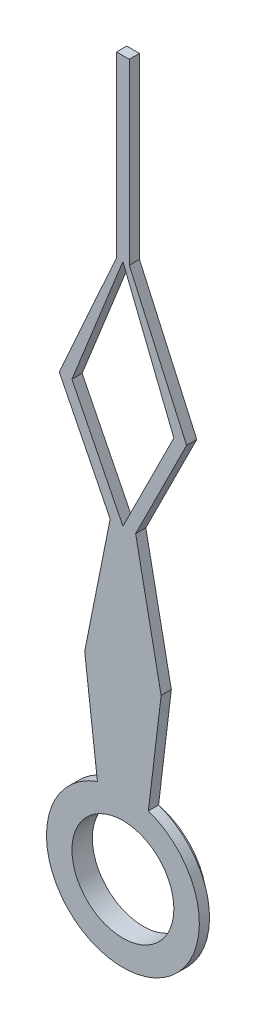
ISO-10303-21;
HEADER;
FILE_DESCRIPTION(('STEP AP214'),'2;1');
FILE_NAME('part.step','',(''),(''),'','','');
FILE_SCHEMA(('AUTOMOTIVE_DESIGN { 1 0 10303 214 1 1 1 1 }'));
ENDSEC;
DATA;
#1=APPLICATION_CONTEXT('core data for automotive mechanical design processes');
#2=APPLICATION_PROTOCOL_DEFINITION('international standard','automotive_design',2000,#1);
#3=PRODUCT_CONTEXT('',#1,'mechanical');
#4=PRODUCT('Part','Part','',(#3));
#5=PRODUCT_RELATED_PRODUCT_CATEGORY('part','',(#4));
#6=PRODUCT_DEFINITION_FORMATION('','',#4);
#7=PRODUCT_DEFINITION_CONTEXT('part definition',#1,'design');
#8=PRODUCT_DEFINITION('design','',#6,#7);
#9=PRODUCT_DEFINITION_SHAPE('','',#8);
#10=(LENGTH_UNIT() NAMED_UNIT(*) SI_UNIT(.MILLI.,.METRE.));
#11=(NAMED_UNIT(*) PLANE_ANGLE_UNIT() SI_UNIT($,.RADIAN.));
#12=(NAMED_UNIT(*) SI_UNIT($,.STERADIAN.) SOLID_ANGLE_UNIT());
#13=UNCERTAINTY_MEASURE_WITH_UNIT(LENGTH_MEASURE(1.E-05),#10,'distance_accuracy_value','');
#14=(GEOMETRIC_REPRESENTATION_CONTEXT(3) GLOBAL_UNCERTAINTY_ASSIGNED_CONTEXT((#13)) GLOBAL_UNIT_ASSIGNED_CONTEXT((#10,
#11,#12)) REPRESENTATION_CONTEXT('',''));
#15=CARTESIAN_POINT('',(0.,0.,0.));
#16=DIRECTION('',(0.,0.,1.));
#17=DIRECTION('',(1.,0.,0.));
#18=AXIS2_PLACEMENT_3D('',#15,#16,#17);
#19=CARTESIAN_POINT('',(0.,0.,0.));
#20=DIRECTION('',(0.,0.,1.));
#21=DIRECTION('',(1.,0.,0.));
#22=AXIS2_PLACEMENT_3D('',#19,#20,#21);
#23=PLANE('',#22);
#24=DIRECTION('',(0.447213595499957,-0.894427190999916,0.));
#25=VECTOR('',#24,1.);
#26=CARTESIAN_POINT('',(0.,6.,0.));
#27=LINE('',#26,#25);
#28=CARTESIAN_POINT('',(-1.,8.,0.));
#29=VERTEX_POINT('',#28);
#30=CARTESIAN_POINT('',(0.,6.,0.));
#31=VERTEX_POINT('',#30);
#32=EDGE_CURVE('E59',#29,#31,#27,.T.);
#33=ORIENTED_EDGE('',*,*,#32,.T.);
#34=DIRECTION('',(0.447213595499958,0.894427190999916,0.));
#35=VECTOR('',#34,1.);
#36=CARTESIAN_POINT('',(0.,6.,0.));
#37=LINE('',#36,#35);
#38=CARTESIAN_POINT('',(0.999999999999999,8.,0.));
#39=VERTEX_POINT('',#38);
#40=EDGE_CURVE('E164',#31,#39,#37,.T.);
#41=ORIENTED_EDGE('',*,*,#40,.T.);
#42=DIRECTION('',(-0.371390676354104,0.928476690885259,0.));
#43=VECTOR('',#42,1.);
#44=CARTESIAN_POINT('',(0.,10.5,0.));
#45=LINE('',#44,#43);
#46=CARTESIAN_POINT('',(0.,10.5,0.));
#47=VERTEX_POINT('',#46);
#48=EDGE_CURVE('E180',#39,#47,#45,.T.);
#49=ORIENTED_EDGE('',*,*,#48,.T.);
#50=DIRECTION('',(-0.371390676354103,-0.92847669088526,0.));
#51=VECTOR('',#50,1.);
#52=CARTESIAN_POINT('',(-1.,8.,0.));
#53=LINE('',#52,#51);
#54=EDGE_CURVE('E158',#47,#29,#53,.T.);
#55=ORIENTED_EDGE('',*,*,#54,.T.);
#56=EDGE_LOOP('',(#33,#41,#49,#55));
#57=FACE_BOUND('',#56,.T.);
#58=DIRECTION('',(-0.410364677328798,-0.911921505175106,0.));
#59=VECTOR('',#58,1.);
#60=CARTESIAN_POINT('',(-1.25,8.,0.));
#61=LINE('',#60,#59);
#62=CARTESIAN_POINT('',(-0.125,10.5,0.));
#63=VERTEX_POINT('',#62);
#64=CARTESIAN_POINT('',(-1.25,8.,0.));
#65=VERTEX_POINT('',#64);
#66=EDGE_CURVE('E190',#63,#65,#61,.T.);
#67=ORIENTED_EDGE('',*,*,#66,.F.);
#68=DIRECTION('',(0.,-1.,0.));
#69=VECTOR('',#68,1.);
#70=CARTESIAN_POINT('',(-0.125,10.5,0.));
#71=LINE('',#70,#69);
#72=CARTESIAN_POINT('',(-0.125,14.,0.));
#73=VERTEX_POINT('',#72);
#74=EDGE_CURVE('E195',#73,#63,#71,.T.);
#75=ORIENTED_EDGE('',*,*,#74,.F.);
#76=DIRECTION('',(-1.,0.,0.));
#77=VECTOR('',#76,1.);
#78=CARTESIAN_POINT('',(-0.125,14.,0.));
#79=LINE('',#78,#77);
#80=CARTESIAN_POINT('',(0.125,14.,0.));
#81=VERTEX_POINT('',#80);
#82=EDGE_CURVE('E238',#81,#73,#79,.T.);
#83=ORIENTED_EDGE('',*,*,#82,.F.);
#84=DIRECTION('',(0.,1.,0.));
#85=VECTOR('',#84,1.);
#86=CARTESIAN_POINT('',(0.125,14.,0.));
#87=LINE('',#86,#85);
#88=CARTESIAN_POINT('',(0.125,10.5,0.));
#89=VERTEX_POINT('',#88);
#90=EDGE_CURVE('E236',#89,#81,#87,.T.);
#91=ORIENTED_EDGE('',*,*,#90,.F.);
#92=DIRECTION('',(-0.410364677328797,0.911921505175107,0.));
#93=VECTOR('',#92,1.);
#94=CARTESIAN_POINT('',(1.25,8.,0.));
#95=LINE('',#94,#93);
#96=CARTESIAN_POINT('',(1.25,8.,0.));
#97=VERTEX_POINT('',#96);
#98=EDGE_CURVE('E234',#97,#89,#95,.T.);
#99=ORIENTED_EDGE('',*,*,#98,.F.);
#100=DIRECTION('',(0.447213595499958,0.894427190999916,0.));
#101=VECTOR('',#100,1.);
#102=CARTESIAN_POINT('',(0.249999999999998,6.,0.));
#103=LINE('',#102,#101);
#104=CARTESIAN_POINT('',(0.249999999999998,6.,0.));
#105=VERTEX_POINT('',#104);
#106=EDGE_CURVE('E232',#105,#97,#103,.T.);
#107=ORIENTED_EDGE('',*,*,#106,.F.);
#108=DIRECTION('',(-0.196116135138184,0.98058067569092,0.));
#109=VECTOR('',#108,1.);
#110=CARTESIAN_POINT('',(0.749999999999999,3.5,0.));
#111=LINE('',#110,#109);
#112=CARTESIAN_POINT('',(0.749999999999999,3.5,0.));
#113=VERTEX_POINT('',#112);
#114=EDGE_CURVE('E230',#113,#105,#111,.T.);
#115=ORIENTED_EDGE('',*,*,#114,.F.);
#116=DIRECTION('',(0.119007079034707,0.992893405728745,0.));
#117=VECTOR('',#116,1.);
#118=CARTESIAN_POINT('',(0.5,1.41421356237309,0.));
#119=LINE('',#118,#117);
#120=CARTESIAN_POINT('',(0.5,1.41421356237309,0.));
#121=VERTEX_POINT('',#120);
#122=EDGE_CURVE('E228',#121,#113,#119,.T.);
#123=ORIENTED_EDGE('',*,*,#122,.F.);
#124=CARTESIAN_POINT('',(0.,0.,0.));
#125=DIRECTION('',(0.,0.,1.));
#126=DIRECTION('',(1.,0.,0.));
#127=AXIS2_PLACEMENT_3D('',#124,#125,#126);
#128=CIRCLE('',#127,1.5);
#129=CARTESIAN_POINT('',(-0.5,1.4142135623731,0.));
#130=VERTEX_POINT('',#129);
#131=EDGE_CURVE('E226',#130,#121,#128,.T.);
#132=ORIENTED_EDGE('',*,*,#131,.F.);
#133=DIRECTION('',(0.119007079034708,-0.992893405728745,0.));
#134=VECTOR('',#133,1.);
#135=CARTESIAN_POINT('',(-0.5,1.4142135623731,0.));
#136=LINE('',#135,#134);
#137=CARTESIAN_POINT('',(-0.75,3.5,0.));
#138=VERTEX_POINT('',#137);
#139=EDGE_CURVE('E224',#138,#130,#136,.T.);
#140=ORIENTED_EDGE('',*,*,#139,.F.);
#141=DIRECTION('',(-0.196116135138184,-0.98058067569092,0.));
#142=VECTOR('',#141,1.);
#143=CARTESIAN_POINT('',(-0.75,3.5,0.));
#144=LINE('',#143,#142);
#145=CARTESIAN_POINT('',(-0.250000000000001,6.,0.));
#146=VERTEX_POINT('',#145);
#147=EDGE_CURVE('E222',#146,#138,#144,.T.);
#148=ORIENTED_EDGE('',*,*,#147,.F.);
#149=DIRECTION('',(0.447213595499958,-0.894427190999916,0.));
#150=VECTOR('',#149,1.);
#151=CARTESIAN_POINT('',(-0.250000000000001,6.,0.));
#152=LINE('',#151,#150);
#153=EDGE_CURVE('E220',#65,#146,#152,.T.);
#154=ORIENTED_EDGE('',*,*,#153,.F.);
#155=EDGE_LOOP('',(#67,#75,#83,#91,#99,#107,#115,#123,#132,#140,#148,#154));
#156=FACE_BOUND('',#155,.T.);
#157=CARTESIAN_POINT('',(0.,0.,0.));
#158=DIRECTION('',(0.,0.,1.));
#159=DIRECTION('',(1.,0.,0.));
#160=AXIS2_PLACEMENT_3D('',#157,#158,#159);
#161=CIRCLE('',#160,1.25);
#162=CARTESIAN_POINT('',(1.25,0.,0.));
#163=VERTEX_POINT('',#162);
#164=EDGE_CURVE('E11',#163,#163,#161,.F.);
#165=ORIENTED_EDGE('',*,*,#164,.F.);
#166=EDGE_LOOP('',(#165));
#167=FACE_BOUND('',#166,.T.);
#168=ADVANCED_FACE('F36',(#57,#156,#167),#23,.F.);
#169=CARTESIAN_POINT('',(0.,0.,0.2));
#170=DIRECTION('',(0.,0.,1.));
#171=DIRECTION('',(1.,0.,0.));
#172=AXIS2_PLACEMENT_3D('',#169,#170,#171);
#173=PLANE('',#172);
#174=CARTESIAN_POINT('',(0.,0.,0.2));
#175=DIRECTION('',(0.,0.,1.));
#176=DIRECTION('',(1.,0.,0.));
#177=AXIS2_PLACEMENT_3D('',#174,#175,#176);
#178=CIRCLE('',#177,1.);
#179=CARTESIAN_POINT('',(1.,0.,0.2));
#180=VERTEX_POINT('',#179);
#181=EDGE_CURVE('E165',#180,#180,#178,.T.);
#182=ORIENTED_EDGE('',*,*,#181,.F.);
#183=EDGE_LOOP('',(#182));
#184=FACE_BOUND('',#183,.T.);
#185=DIRECTION('',(-0.410364677328798,-0.911921505175106,0.));
#186=VECTOR('',#185,1.);
#187=CARTESIAN_POINT('',(-1.25,8.,0.2));
#188=LINE('',#187,#186);
#189=CARTESIAN_POINT('',(-0.125,10.5,0.2));
#190=VERTEX_POINT('',#189);
#191=CARTESIAN_POINT('',(-1.25,8.,0.2));
#192=VERTEX_POINT('',#191);
#193=EDGE_CURVE('E191',#190,#192,#188,.T.);
#194=ORIENTED_EDGE('',*,*,#193,.T.);
#195=DIRECTION('',(0.447213595499958,-0.894427190999916,0.));
#196=VECTOR('',#195,1.);
#197=CARTESIAN_POINT('',(-0.250000000000001,6.,0.2));
#198=LINE('',#197,#196);
#199=CARTESIAN_POINT('',(-0.250000000000001,6.,0.2));
#200=VERTEX_POINT('',#199);
#201=EDGE_CURVE('E194',#192,#200,#198,.T.);
#202=ORIENTED_EDGE('',*,*,#201,.T.);
#203=DIRECTION('',(-0.196116135138184,-0.98058067569092,0.));
#204=VECTOR('',#203,1.);
#205=CARTESIAN_POINT('',(-0.75,3.5,0.2));
#206=LINE('',#205,#204);
#207=CARTESIAN_POINT('',(-0.75,3.5,0.2));
#208=VERTEX_POINT('',#207);
#209=EDGE_CURVE('E197',#200,#208,#206,.T.);
#210=ORIENTED_EDGE('',*,*,#209,.T.);
#211=DIRECTION('',(0.119007079034708,-0.992893405728745,0.));
#212=VECTOR('',#211,1.);
#213=CARTESIAN_POINT('',(-0.5,1.4142135623731,0.2));
#214=LINE('',#213,#212);
#215=CARTESIAN_POINT('',(-0.5,1.4142135623731,0.2));
#216=VERTEX_POINT('',#215);
#217=EDGE_CURVE('E199',#208,#216,#214,.T.);
#218=ORIENTED_EDGE('',*,*,#217,.T.);
#219=CARTESIAN_POINT('',(0.,0.,0.2));
#220=DIRECTION('',(0.,0.,1.));
#221=DIRECTION('',(1.,0.,0.));
#222=AXIS2_PLACEMENT_3D('',#219,#220,#221);
#223=CIRCLE('',#222,1.5);
#224=CARTESIAN_POINT('',(0.5,1.41421356237309,0.2));
#225=VERTEX_POINT('',#224);
#226=EDGE_CURVE('E201',#216,#225,#223,.T.);
#227=ORIENTED_EDGE('',*,*,#226,.T.);
#228=DIRECTION('',(0.119007079034707,0.992893405728745,0.));
#229=VECTOR('',#228,1.);
#230=CARTESIAN_POINT('',(0.5,1.41421356237309,0.2));
#231=LINE('',#230,#229);
#232=CARTESIAN_POINT('',(0.749999999999999,3.5,0.2));
#233=VERTEX_POINT('',#232);
#234=EDGE_CURVE('E203',#225,#233,#231,.T.);
#235=ORIENTED_EDGE('',*,*,#234,.T.);
#236=DIRECTION('',(-0.196116135138184,0.98058067569092,0.));
#237=VECTOR('',#236,1.);
#238=CARTESIAN_POINT('',(0.749999999999999,3.5,0.2));
#239=LINE('',#238,#237);
#240=CARTESIAN_POINT('',(0.249999999999998,6.,0.2));
#241=VERTEX_POINT('',#240);
#242=EDGE_CURVE('E205',#233,#241,#239,.T.);
#243=ORIENTED_EDGE('',*,*,#242,.T.);
#244=DIRECTION('',(0.447213595499958,0.894427190999916,0.));
#245=VECTOR('',#244,1.);
#246=CARTESIAN_POINT('',(0.249999999999998,6.,0.2));
#247=LINE('',#246,#245);
#248=CARTESIAN_POINT('',(1.25,8.,0.2));
#249=VERTEX_POINT('',#248);
#250=EDGE_CURVE('E207',#241,#249,#247,.T.);
#251=ORIENTED_EDGE('',*,*,#250,.T.);
#252=DIRECTION('',(-0.410364677328797,0.911921505175107,0.));
#253=VECTOR('',#252,1.);
#254=CARTESIAN_POINT('',(1.25,8.,0.2));
#255=LINE('',#254,#253);
#256=CARTESIAN_POINT('',(0.125,10.5,0.2));
#257=VERTEX_POINT('',#256);
#258=EDGE_CURVE('E209',#249,#257,#255,.T.);
#259=ORIENTED_EDGE('',*,*,#258,.T.);
#260=DIRECTION('',(0.,1.,0.));
#261=VECTOR('',#260,1.);
#262=CARTESIAN_POINT('',(0.125,14.,0.2));
#263=LINE('',#262,#261);
#264=CARTESIAN_POINT('',(0.125,14.,0.2));
#265=VERTEX_POINT('',#264);
#266=EDGE_CURVE('E211',#257,#265,#263,.T.);
#267=ORIENTED_EDGE('',*,*,#266,.T.);
#268=DIRECTION('',(-1.,0.,0.));
#269=VECTOR('',#268,1.);
#270=CARTESIAN_POINT('',(-0.125,14.,0.2));
#271=LINE('',#270,#269);
#272=CARTESIAN_POINT('',(-0.125,14.,0.2));
#273=VERTEX_POINT('',#272);
#274=EDGE_CURVE('E213',#265,#273,#271,.T.);
#275=ORIENTED_EDGE('',*,*,#274,.T.);
#276=DIRECTION('',(0.,-1.,0.));
#277=VECTOR('',#276,1.);
#278=CARTESIAN_POINT('',(-0.125,10.5,0.2));
#279=LINE('',#278,#277);
#280=EDGE_CURVE('E215',#273,#190,#279,.T.);
#281=ORIENTED_EDGE('',*,*,#280,.T.);
#282=EDGE_LOOP('',(#194,#202,#210,#218,#227,#235,#243,#251,#259,#267,#275,#281));
#283=FACE_BOUND('',#282,.T.);
#284=DIRECTION('',(0.447213595499958,0.894427190999916,0.));
#285=VECTOR('',#284,1.);
#286=CARTESIAN_POINT('',(0.,6.,0.2));
#287=LINE('',#286,#285);
#288=CARTESIAN_POINT('',(0.,6.,0.2));
#289=VERTEX_POINT('',#288);
#290=CARTESIAN_POINT('',(0.999999999999999,8.,0.2));
#291=VERTEX_POINT('',#290);
#292=EDGE_CURVE('E157',#289,#291,#287,.T.);
#293=ORIENTED_EDGE('',*,*,#292,.F.);
#294=DIRECTION('',(0.447213595499957,-0.894427190999916,0.));
#295=VECTOR('',#294,1.);
#296=CARTESIAN_POINT('',(0.,6.,0.2));
#297=LINE('',#296,#295);
#298=CARTESIAN_POINT('',(-1.,8.,0.2));
#299=VERTEX_POINT('',#298);
#300=EDGE_CURVE('E149',#299,#289,#297,.T.);
#301=ORIENTED_EDGE('',*,*,#300,.F.);
#302=DIRECTION('',(-0.371390676354103,-0.92847669088526,0.));
#303=VECTOR('',#302,1.);
#304=CARTESIAN_POINT('',(-1.,8.,0.2));
#305=LINE('',#304,#303);
#306=CARTESIAN_POINT('',(0.,10.5,0.2));
#307=VERTEX_POINT('',#306);
#308=EDGE_CURVE('E172',#307,#299,#305,.T.);
#309=ORIENTED_EDGE('',*,*,#308,.F.);
#310=DIRECTION('',(-0.371390676354104,0.928476690885259,0.));
#311=VECTOR('',#310,1.);
#312=CARTESIAN_POINT('',(0.,10.5,0.2));
#313=LINE('',#312,#311);
#314=EDGE_CURVE('E170',#291,#307,#313,.T.);
#315=ORIENTED_EDGE('',*,*,#314,.F.);
#316=EDGE_LOOP('',(#293,#301,#309,#315));
#317=FACE_BOUND('',#316,.T.);
#318=ADVANCED_FACE('F169',(#184,#283,#317),#173,.T.);
#319=CARTESIAN_POINT('',(-1.25,8.,0.2));
#320=DIRECTION('',(0.911921505175106,-0.410364677328798,0.));
#321=DIRECTION('',(0.410364677328798,0.911921505175106,0.));
#322=AXIS2_PLACEMENT_3D('',#319,#320,#321);
#323=PLANE('',#322);
#324=ORIENTED_EDGE('',*,*,#66,.T.);
#325=DIRECTION('',(0.,0.,-1.));
#326=VECTOR('',#325,1.);
#327=CARTESIAN_POINT('',(-1.25,8.,0.2));
#328=LINE('',#327,#326);
#329=EDGE_CURVE('E44',#192,#65,#328,.T.);
#330=ORIENTED_EDGE('',*,*,#329,.F.);
#331=ORIENTED_EDGE('',*,*,#193,.F.);
#332=DIRECTION('',(0.,0.,-1.));
#333=VECTOR('',#332,1.);
#334=CARTESIAN_POINT('',(-0.125,10.5,0.2));
#335=LINE('',#334,#333);
#336=EDGE_CURVE('E217',#190,#63,#335,.T.);
#337=ORIENTED_EDGE('',*,*,#336,.T.);
#338=EDGE_LOOP('',(#324,#330,#331,#337));
#339=FACE_BOUND('',#338,.T.);
#340=ADVANCED_FACE('F38',(#339),#323,.F.);
#341=CARTESIAN_POINT('',(-0.250000000000001,6.,0.2));
#342=DIRECTION('',(0.894427190999916,0.447213595499958,0.));
#343=DIRECTION('',(-0.447213595499958,0.894427190999916,0.));
#344=AXIS2_PLACEMENT_3D('',#341,#342,#343);
#345=PLANE('',#344);
#346=ORIENTED_EDGE('',*,*,#153,.T.);
#347=DIRECTION('',(0.,0.,-1.));
#348=VECTOR('',#347,1.);
#349=CARTESIAN_POINT('',(-0.250000000000001,6.,0.2));
#350=LINE('',#349,#348);
#351=EDGE_CURVE('E270',#200,#146,#350,.T.);
#352=ORIENTED_EDGE('',*,*,#351,.F.);
#353=ORIENTED_EDGE('',*,*,#201,.F.);
#354=ORIENTED_EDGE('',*,*,#329,.T.);
#355=EDGE_LOOP('',(#346,#352,#353,#354));
#356=FACE_BOUND('',#355,.T.);
#357=ADVANCED_FACE('F275',(#356),#345,.F.);
#358=CARTESIAN_POINT('',(-0.75,3.5,0.2));
#359=DIRECTION('',(0.98058067569092,-0.196116135138184,0.));
#360=DIRECTION('',(0.196116135138184,0.98058067569092,0.));
#361=AXIS2_PLACEMENT_3D('',#358,#359,#360);
#362=PLANE('',#361);
#363=ORIENTED_EDGE('',*,*,#147,.T.);
#364=DIRECTION('',(0.,0.,-1.));
#365=VECTOR('',#364,1.);
#366=CARTESIAN_POINT('',(-0.75,3.5,0.2));
#367=LINE('',#366,#365);
#368=EDGE_CURVE('E267',#208,#138,#367,.T.);
#369=ORIENTED_EDGE('',*,*,#368,.F.);
#370=ORIENTED_EDGE('',*,*,#209,.F.);
#371=ORIENTED_EDGE('',*,*,#351,.T.);
#372=EDGE_LOOP('',(#363,#369,#370,#371));
#373=FACE_BOUND('',#372,.T.);
#374=ADVANCED_FACE('F290',(#373),#362,.F.);
#375=CARTESIAN_POINT('',(-0.5,1.4142135623731,0.2));
#376=DIRECTION('',(0.992893405728745,0.119007079034708,0.));
#377=DIRECTION('',(-0.119007079034708,0.992893405728745,0.));
#378=AXIS2_PLACEMENT_3D('',#375,#376,#377);
#379=PLANE('',#378);
#380=ORIENTED_EDGE('',*,*,#139,.T.);
#381=DIRECTION('',(0.,0.,-1.));
#382=VECTOR('',#381,1.);
#383=CARTESIAN_POINT('',(-0.5,1.4142135623731,0.2));
#384=LINE('',#383,#382);
#385=EDGE_CURVE('E264',#216,#130,#384,.T.);
#386=ORIENTED_EDGE('',*,*,#385,.F.);
#387=ORIENTED_EDGE('',*,*,#217,.F.);
#388=ORIENTED_EDGE('',*,*,#368,.T.);
#389=EDGE_LOOP('',(#380,#386,#387,#388));
#390=FACE_BOUND('',#389,.T.);
#391=ADVANCED_FACE('F294',(#390),#379,.F.);
#392=CARTESIAN_POINT('',(0.,0.,0.2));
#393=DIRECTION('',(0.,0.,-1.));
#394=DIRECTION('',(-1.,0.,0.));
#395=AXIS2_PLACEMENT_3D('',#392,#393,#394);
#396=CYLINDRICAL_SURFACE('',#395,1.5);
#397=ORIENTED_EDGE('',*,*,#131,.T.);
#398=DIRECTION('',(0.,0.,-1.));
#399=VECTOR('',#398,1.);
#400=CARTESIAN_POINT('',(0.5,1.41421356237309,0.2));
#401=LINE('',#400,#399);
#402=EDGE_CURVE('E261',#225,#121,#401,.T.);
#403=ORIENTED_EDGE('',*,*,#402,.F.);
#404=ORIENTED_EDGE('',*,*,#226,.F.);
#405=ORIENTED_EDGE('',*,*,#385,.T.);
#406=EDGE_LOOP('',(#397,#403,#404,#405));
#407=FACE_BOUND('',#406,.T.);
#408=ADVANCED_FACE('F332',(#407),#396,.T.);
#409=CARTESIAN_POINT('',(0.5,1.41421356237309,0.2));
#410=DIRECTION('',(-0.992893405728745,0.119007079034707,0.));
#411=DIRECTION('',(-0.119007079034707,-0.992893405728745,0.));
#412=AXIS2_PLACEMENT_3D('',#409,#410,#411);
#413=PLANE('',#412);
#414=ORIENTED_EDGE('',*,*,#122,.T.);
#415=DIRECTION('',(0.,0.,-1.));
#416=VECTOR('',#415,1.);
#417=CARTESIAN_POINT('',(0.749999999999999,3.5,0.2));
#418=LINE('',#417,#416);
#419=EDGE_CURVE('E258',#233,#113,#418,.T.);
#420=ORIENTED_EDGE('',*,*,#419,.F.);
#421=ORIENTED_EDGE('',*,*,#234,.F.);
#422=ORIENTED_EDGE('',*,*,#402,.T.);
#423=EDGE_LOOP('',(#414,#420,#421,#422));
#424=FACE_BOUND('',#423,.T.);
#425=ADVANCED_FACE('F330',(#424),#413,.F.);
#426=CARTESIAN_POINT('',(0.749999999999999,3.5,0.2));
#427=DIRECTION('',(-0.98058067569092,-0.196116135138184,0.));
#428=DIRECTION('',(0.196116135138184,-0.98058067569092,0.));
#429=AXIS2_PLACEMENT_3D('',#426,#427,#428);
#430=PLANE('',#429);
#431=ORIENTED_EDGE('',*,*,#114,.T.);
#432=DIRECTION('',(0.,0.,-1.));
#433=VECTOR('',#432,1.);
#434=CARTESIAN_POINT('',(0.249999999999998,6.,0.2));
#435=LINE('',#434,#433);
#436=EDGE_CURVE('E255',#241,#105,#435,.T.);
#437=ORIENTED_EDGE('',*,*,#436,.F.);
#438=ORIENTED_EDGE('',*,*,#242,.F.);
#439=ORIENTED_EDGE('',*,*,#419,.T.);
#440=EDGE_LOOP('',(#431,#437,#438,#439));
#441=FACE_BOUND('',#440,.T.);
#442=ADVANCED_FACE('F325',(#441),#430,.F.);
#443=CARTESIAN_POINT('',(0.249999999999998,6.,0.2));
#444=DIRECTION('',(-0.894427190999916,0.447213595499958,0.));
#445=DIRECTION('',(-0.447213595499958,-0.894427190999916,0.));
#446=AXIS2_PLACEMENT_3D('',#443,#444,#445);
#447=PLANE('',#446);
#448=ORIENTED_EDGE('',*,*,#106,.T.);
#449=DIRECTION('',(0.,0.,-1.));
#450=VECTOR('',#449,1.);
#451=CARTESIAN_POINT('',(1.25,8.,0.2));
#452=LINE('',#451,#450);
#453=EDGE_CURVE('E252',#249,#97,#452,.T.);
#454=ORIENTED_EDGE('',*,*,#453,.F.);
#455=ORIENTED_EDGE('',*,*,#250,.F.);
#456=ORIENTED_EDGE('',*,*,#436,.T.);
#457=EDGE_LOOP('',(#448,#454,#455,#456));
#458=FACE_BOUND('',#457,.T.);
#459=ADVANCED_FACE('F320',(#458),#447,.F.);
#460=CARTESIAN_POINT('',(1.25,8.,0.2));
#461=DIRECTION('',(-0.911921505175107,-0.410364677328797,0.));
#462=DIRECTION('',(0.410364677328797,-0.911921505175107,0.));
#463=AXIS2_PLACEMENT_3D('',#460,#461,#462);
#464=PLANE('',#463);
#465=ORIENTED_EDGE('',*,*,#98,.T.);
#466=DIRECTION('',(0.,0.,-1.));
#467=VECTOR('',#466,1.);
#468=CARTESIAN_POINT('',(0.125,10.5,0.2));
#469=LINE('',#468,#467);
#470=EDGE_CURVE('E249',#257,#89,#469,.T.);
#471=ORIENTED_EDGE('',*,*,#470,.F.);
#472=ORIENTED_EDGE('',*,*,#258,.F.);
#473=ORIENTED_EDGE('',*,*,#453,.T.);
#474=EDGE_LOOP('',(#465,#471,#472,#473));
#475=FACE_BOUND('',#474,.T.);
#476=ADVANCED_FACE('F316',(#475),#464,.F.);
#477=CARTESIAN_POINT('',(0.125,14.,0.2));
#478=DIRECTION('',(-1.,0.,0.));
#479=DIRECTION('',(0.,-1.,0.));
#480=AXIS2_PLACEMENT_3D('',#477,#478,#479);
#481=PLANE('',#480);
#482=ORIENTED_EDGE('',*,*,#90,.T.);
#483=DIRECTION('',(0.,0.,-1.));
#484=VECTOR('',#483,1.);
#485=CARTESIAN_POINT('',(0.125,14.,0.2));
#486=LINE('',#485,#484);
#487=EDGE_CURVE('E246',#265,#81,#486,.T.);
#488=ORIENTED_EDGE('',*,*,#487,.F.);
#489=ORIENTED_EDGE('',*,*,#266,.F.);
#490=ORIENTED_EDGE('',*,*,#470,.T.);
#491=EDGE_LOOP('',(#482,#488,#489,#490));
#492=FACE_BOUND('',#491,.T.);
#493=ADVANCED_FACE('F311',(#492),#481,.F.);
#494=CARTESIAN_POINT('',(-0.125,14.,0.2));
#495=DIRECTION('',(0.,-1.,0.));
#496=DIRECTION('',(0.,0.,-1.));
#497=AXIS2_PLACEMENT_3D('',#494,#495,#496);
#498=PLANE('',#497);
#499=ORIENTED_EDGE('',*,*,#82,.T.);
#500=DIRECTION('',(0.,0.,-1.));
#501=VECTOR('',#500,1.);
#502=CARTESIAN_POINT('',(-0.125,14.,0.2));
#503=LINE('',#502,#501);
#504=EDGE_CURVE('E243',#273,#73,#503,.T.);
#505=ORIENTED_EDGE('',*,*,#504,.F.);
#506=ORIENTED_EDGE('',*,*,#274,.F.);
#507=ORIENTED_EDGE('',*,*,#487,.T.);
#508=EDGE_LOOP('',(#499,#505,#506,#507));
#509=FACE_BOUND('',#508,.T.);
#510=ADVANCED_FACE('F305',(#509),#498,.F.);
#511=CARTESIAN_POINT('',(-0.125,10.5,0.2));
#512=DIRECTION('',(1.,0.,0.));
#513=DIRECTION('',(0.,0.,-1.));
#514=AXIS2_PLACEMENT_3D('',#511,#512,#513);
#515=PLANE('',#514);
#516=ORIENTED_EDGE('',*,*,#74,.T.);
#517=ORIENTED_EDGE('',*,*,#336,.F.);
#518=ORIENTED_EDGE('',*,*,#280,.F.);
#519=ORIENTED_EDGE('',*,*,#504,.T.);
#520=EDGE_LOOP('',(#516,#517,#518,#519));
#521=FACE_BOUND('',#520,.T.);
#522=ADVANCED_FACE('F303',(#521),#515,.F.);
#523=CARTESIAN_POINT('',(0.,0.,0.2));
#524=DIRECTION('',(0.,0.,-1.));
#525=DIRECTION('',(-1.,0.,0.));
#526=AXIS2_PLACEMENT_3D('',#523,#524,#525);
#527=CYLINDRICAL_SURFACE('',#526,1.);
#528=ORIENTED_EDGE('',*,*,#181,.T.);
#529=EDGE_LOOP('',(#528));
#530=FACE_BOUND('',#529,.T.);
#531=CARTESIAN_POINT('',(0.,0.,-0.2));
#532=DIRECTION('',(0.,0.,-1.));
#533=DIRECTION('',(-1.,0.,0.));
#534=AXIS2_PLACEMENT_3D('',#531,#532,#533);
#535=CIRCLE('',#534,1.);
#536=CARTESIAN_POINT('',(-1.,0.,-0.2));
#537=VERTEX_POINT('',#536);
#538=EDGE_CURVE('E555',#537,#537,#535,.T.);
#539=ORIENTED_EDGE('',*,*,#538,.T.);
#540=EDGE_LOOP('',(#539));
#541=FACE_BOUND('',#540,.T.);
#542=ADVANCED_FACE('F353',(#530,#541),#527,.F.);
#543=CARTESIAN_POINT('',(0.,6.,0.2));
#544=DIRECTION('',(0.894427190999916,0.447213595499957,0.));
#545=DIRECTION('',(-0.447213595499957,0.894427190999916,0.));
#546=AXIS2_PLACEMENT_3D('',#543,#544,#545);
#547=PLANE('',#546);
#548=ORIENTED_EDGE('',*,*,#32,.F.);
#549=DIRECTION('',(0.,0.,-1.));
#550=VECTOR('',#549,1.);
#551=CARTESIAN_POINT('',(-1.,8.,0.2));
#552=LINE('',#551,#550);
#553=EDGE_CURVE('E153',#299,#29,#552,.T.);
#554=ORIENTED_EDGE('',*,*,#553,.F.);
#555=ORIENTED_EDGE('',*,*,#300,.T.);
#556=DIRECTION('',(0.,0.,-1.));
#557=VECTOR('',#556,1.);
#558=CARTESIAN_POINT('',(0.,6.,0.2));
#559=LINE('',#558,#557);
#560=EDGE_CURVE('E152',#289,#31,#559,.T.);
#561=ORIENTED_EDGE('',*,*,#560,.T.);
#562=EDGE_LOOP('',(#548,#554,#555,#561));
#563=FACE_BOUND('',#562,.T.);
#564=ADVANCED_FACE('F151',(#563),#547,.T.);
#565=CARTESIAN_POINT('',(0.,6.,0.2));
#566=DIRECTION('',(-0.894427190999916,0.447213595499958,0.));
#567=DIRECTION('',(-0.447213595499958,-0.894427190999916,0.));
#568=AXIS2_PLACEMENT_3D('',#565,#566,#567);
#569=PLANE('',#568);
#570=ORIENTED_EDGE('',*,*,#40,.F.);
#571=ORIENTED_EDGE('',*,*,#560,.F.);
#572=ORIENTED_EDGE('',*,*,#292,.T.);
#573=DIRECTION('',(0.,0.,-1.));
#574=VECTOR('',#573,1.);
#575=CARTESIAN_POINT('',(0.999999999999999,8.,0.2));
#576=LINE('',#575,#574);
#577=EDGE_CURVE('E166',#291,#39,#576,.T.);
#578=ORIENTED_EDGE('',*,*,#577,.T.);
#579=EDGE_LOOP('',(#570,#571,#572,#578));
#580=FACE_BOUND('',#579,.T.);
#581=ADVANCED_FACE('F161',(#580),#569,.T.);
#582=CARTESIAN_POINT('',(0.,10.5,0.2));
#583=DIRECTION('',(-0.928476690885259,-0.371390676354104,0.));
#584=DIRECTION('',(0.371390676354104,-0.928476690885259,0.));
#585=AXIS2_PLACEMENT_3D('',#582,#583,#584);
#586=PLANE('',#585);
#587=ORIENTED_EDGE('',*,*,#48,.F.);
#588=ORIENTED_EDGE('',*,*,#577,.F.);
#589=ORIENTED_EDGE('',*,*,#314,.T.);
#590=DIRECTION('',(0.,0.,-1.));
#591=VECTOR('',#590,1.);
#592=CARTESIAN_POINT('',(0.,10.5,0.2));
#593=LINE('',#592,#591);
#594=EDGE_CURVE('E51',#307,#47,#593,.T.);
#595=ORIENTED_EDGE('',*,*,#594,.T.);
#596=EDGE_LOOP('',(#587,#588,#589,#595));
#597=FACE_BOUND('',#596,.T.);
#598=ADVANCED_FACE('F410',(#597),#586,.T.);
#599=CARTESIAN_POINT('',(-1.,8.,0.2));
#600=DIRECTION('',(0.92847669088526,-0.371390676354103,0.));
#601=DIRECTION('',(0.371390676354103,0.92847669088526,0.));
#602=AXIS2_PLACEMENT_3D('',#599,#600,#601);
#603=PLANE('',#602);
#604=ORIENTED_EDGE('',*,*,#54,.F.);
#605=ORIENTED_EDGE('',*,*,#594,.F.);
#606=ORIENTED_EDGE('',*,*,#308,.T.);
#607=ORIENTED_EDGE('',*,*,#553,.T.);
#608=EDGE_LOOP('',(#604,#605,#606,#607));
#609=FACE_BOUND('',#608,.T.);
#610=ADVANCED_FACE('F417',(#609),#603,.T.);
#611=CARTESIAN_POINT('',(0.,0.,-0.2));
#612=DIRECTION('',(0.,0.,-1.));
#613=DIRECTION('',(-1.,0.,0.));
#614=AXIS2_PLACEMENT_3D('',#611,#612,#613);
#615=PLANE('',#614);
#616=CARTESIAN_POINT('',(0.,0.,-0.2));
#617=DIRECTION('',(0.,0.,-1.));
#618=DIRECTION('',(-1.,0.,0.));
#619=AXIS2_PLACEMENT_3D('',#616,#617,#618);
#620=CIRCLE('',#619,1.25);
#621=CARTESIAN_POINT('',(-1.25,0.,-0.2));
#622=VERTEX_POINT('',#621);
#623=EDGE_CURVE('E178',#622,#622,#620,.T.);
#624=ORIENTED_EDGE('',*,*,#623,.T.);
#625=EDGE_LOOP('',(#624));
#626=FACE_BOUND('',#625,.T.);
#627=ORIENTED_EDGE('',*,*,#538,.F.);
#628=EDGE_LOOP('',(#627));
#629=FACE_BOUND('',#628,.T.);
#630=ADVANCED_FACE('F424',(#626,#629),#615,.T.);
#631=CARTESIAN_POINT('',(0.,0.,-0.2));
#632=DIRECTION('',(0.,0.,1.));
#633=DIRECTION('',(1.,0.,0.));
#634=AXIS2_PLACEMENT_3D('',#631,#632,#633);
#635=CYLINDRICAL_SURFACE('',#634,1.25);
#636=ORIENTED_EDGE('',*,*,#623,.F.);
#637=EDGE_LOOP('',(#636));
#638=FACE_BOUND('',#637,.T.);
#639=ORIENTED_EDGE('',*,*,#164,.T.);
#640=EDGE_LOOP('',(#639));
#641=FACE_BOUND('',#640,.T.);
#642=ADVANCED_FACE('F431',(#638,#641),#635,.T.);
#643=CLOSED_SHELL('',(#168,#318,#340,#357,#374,#391,#408,#425,#442,#459,#476,#493,#510,#522,
#542,#564,#581,#598,#610,#630,#642));
#644=MANIFOLD_SOLID_BREP('B2',#643);
#645=ADVANCED_BREP_SHAPE_REPRESENTATION('',(#18,#644),#14);
#646=SHAPE_DEFINITION_REPRESENTATION(#9,#645);
ENDSEC;
END-ISO-10303-21;
